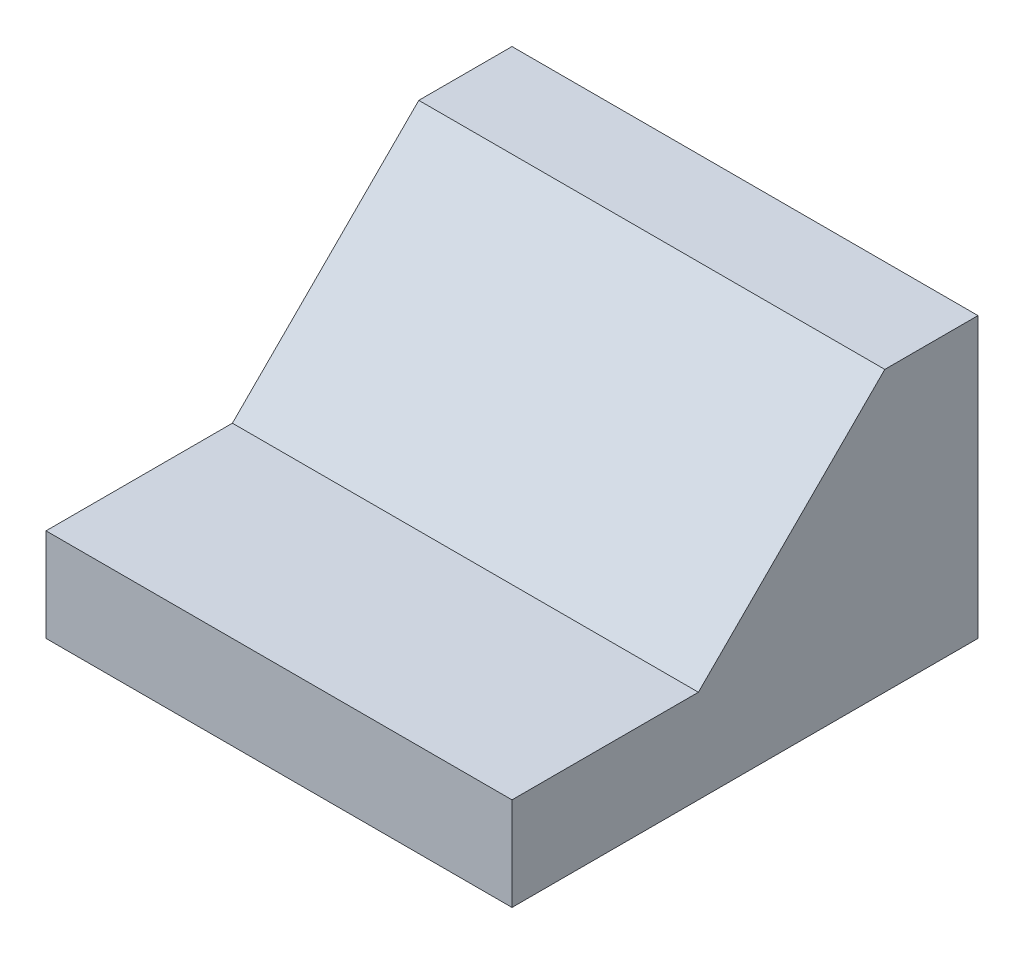
ISO-10303-21;
HEADER;
FILE_DESCRIPTION(('STEP AP214'),'2;1');
FILE_NAME('part.step','',(''),(''),'','','');
FILE_SCHEMA(('AUTOMOTIVE_DESIGN { 1 0 10303 214 1 1 1 1 }'));
ENDSEC;
DATA;
#1=APPLICATION_CONTEXT('core data for automotive mechanical design processes');
#2=APPLICATION_PROTOCOL_DEFINITION('international standard','automotive_design',2000,#1);
#3=PRODUCT_CONTEXT('',#1,'mechanical');
#4=PRODUCT('Part','Part','',(#3));
#5=PRODUCT_RELATED_PRODUCT_CATEGORY('part','',(#4));
#6=PRODUCT_DEFINITION_FORMATION('','',#4);
#7=PRODUCT_DEFINITION_CONTEXT('part definition',#1,'design');
#8=PRODUCT_DEFINITION('design','',#6,#7);
#9=PRODUCT_DEFINITION_SHAPE('','',#8);
#10=(LENGTH_UNIT() NAMED_UNIT(*) SI_UNIT(.MILLI.,.METRE.));
#11=(NAMED_UNIT(*) PLANE_ANGLE_UNIT() SI_UNIT($,.RADIAN.));
#12=(NAMED_UNIT(*) SI_UNIT($,.STERADIAN.) SOLID_ANGLE_UNIT());
#13=UNCERTAINTY_MEASURE_WITH_UNIT(LENGTH_MEASURE(1.E-05),#10,'distance_accuracy_value','');
#14=(GEOMETRIC_REPRESENTATION_CONTEXT(3) GLOBAL_UNCERTAINTY_ASSIGNED_CONTEXT((#13)) GLOBAL_UNIT_ASSIGNED_CONTEXT((#10,
#11,#12)) REPRESENTATION_CONTEXT('',''));
#15=CARTESIAN_POINT('',(0.,0.,0.));
#16=DIRECTION('',(0.,0.,1.));
#17=DIRECTION('',(1.,0.,0.));
#18=AXIS2_PLACEMENT_3D('',#15,#16,#17);
#19=CARTESIAN_POINT('',(10.,0.,9.99999999999999));
#20=DIRECTION('',(0.,1.,0.));
#21=DIRECTION('',(0.,0.,1.));
#22=AXIS2_PLACEMENT_3D('',#19,#20,#21);
#23=PLANE('',#22);
#24=DIRECTION('',(0.,0.,-1.));
#25=VECTOR('',#24,1.);
#26=CARTESIAN_POINT('',(0.,0.,9.99999999999999));
#27=LINE('',#26,#25);
#28=CARTESIAN_POINT('',(0.,0.,9.99999999999999));
#29=VERTEX_POINT('',#28);
#30=CARTESIAN_POINT('',(0.,0.,0.));
#31=VERTEX_POINT('',#30);
#32=EDGE_CURVE('E116',#29,#31,#27,.T.);
#33=ORIENTED_EDGE('',*,*,#32,.T.);
#34=DIRECTION('',(-1.,0.,0.));
#35=VECTOR('',#34,1.);
#36=CARTESIAN_POINT('',(10.,0.,0.));
#37=LINE('',#36,#35);
#38=CARTESIAN_POINT('',(10.,0.,0.));
#39=VERTEX_POINT('',#38);
#40=EDGE_CURVE('E11',#39,#31,#37,.T.);
#41=ORIENTED_EDGE('',*,*,#40,.F.);
#42=DIRECTION('',(0.,0.,-1.));
#43=VECTOR('',#42,1.);
#44=CARTESIAN_POINT('',(10.,0.,9.99999999999999));
#45=LINE('',#44,#43);
#46=CARTESIAN_POINT('',(10.,0.,9.99999999999999));
#47=VERTEX_POINT('',#46);
#48=EDGE_CURVE('E126',#47,#39,#45,.T.);
#49=ORIENTED_EDGE('',*,*,#48,.F.);
#50=DIRECTION('',(-1.,0.,0.));
#51=VECTOR('',#50,1.);
#52=CARTESIAN_POINT('',(10.,0.,9.99999999999999));
#53=LINE('',#52,#51);
#54=EDGE_CURVE('E112',#47,#29,#53,.T.);
#55=ORIENTED_EDGE('',*,*,#54,.T.);
#56=EDGE_LOOP('',(#33,#41,#49,#55));
#57=FACE_BOUND('',#56,.T.);
#58=ADVANCED_FACE('F32',(#57),#23,.F.);
#59=CARTESIAN_POINT('',(10.,0.,0.));
#60=DIRECTION('',(0.,0.,1.));
#61=DIRECTION('',(1.,0.,0.));
#62=AXIS2_PLACEMENT_3D('',#59,#60,#61);
#63=PLANE('',#62);
#64=DIRECTION('',(0.,1.,0.));
#65=VECTOR('',#64,1.);
#66=CARTESIAN_POINT('',(0.,0.,0.));
#67=LINE('',#66,#65);
#68=CARTESIAN_POINT('',(0.,6.,0.));
#69=VERTEX_POINT('',#68);
#70=EDGE_CURVE('E119',#31,#69,#67,.T.);
#71=ORIENTED_EDGE('',*,*,#70,.T.);
#72=DIRECTION('',(-1.,0.,0.));
#73=VECTOR('',#72,1.);
#74=CARTESIAN_POINT('',(10.,6.,0.));
#75=LINE('',#74,#73);
#76=CARTESIAN_POINT('',(10.,6.,0.));
#77=VERTEX_POINT('',#76);
#78=EDGE_CURVE('E40',#77,#69,#75,.T.);
#79=ORIENTED_EDGE('',*,*,#78,.F.);
#80=DIRECTION('',(0.,1.,0.));
#81=VECTOR('',#80,1.);
#82=CARTESIAN_POINT('',(10.,0.,0.));
#83=LINE('',#82,#81);
#84=EDGE_CURVE('E85',#39,#77,#83,.T.);
#85=ORIENTED_EDGE('',*,*,#84,.F.);
#86=ORIENTED_EDGE('',*,*,#40,.T.);
#87=EDGE_LOOP('',(#71,#79,#85,#86));
#88=FACE_BOUND('',#87,.T.);
#89=ADVANCED_FACE('F150',(#88),#63,.F.);
#90=CARTESIAN_POINT('',(10.,6.,0.));
#91=DIRECTION('',(0.,-1.,0.));
#92=DIRECTION('',(0.,0.,-1.));
#93=AXIS2_PLACEMENT_3D('',#90,#91,#92);
#94=PLANE('',#93);
#95=DIRECTION('',(0.,0.,1.));
#96=VECTOR('',#95,1.);
#97=CARTESIAN_POINT('',(0.,6.,0.));
#98=LINE('',#97,#96);
#99=CARTESIAN_POINT('',(0.,6.,2.));
#100=VERTEX_POINT('',#99);
#101=EDGE_CURVE('E121',#69,#100,#98,.T.);
#102=ORIENTED_EDGE('',*,*,#101,.T.);
#103=DIRECTION('',(-1.,0.,0.));
#104=VECTOR('',#103,1.);
#105=CARTESIAN_POINT('',(10.,6.,2.));
#106=LINE('',#105,#104);
#107=CARTESIAN_POINT('',(10.,6.,2.));
#108=VERTEX_POINT('',#107);
#109=EDGE_CURVE('E107',#108,#100,#106,.T.);
#110=ORIENTED_EDGE('',*,*,#109,.F.);
#111=DIRECTION('',(0.,0.,1.));
#112=VECTOR('',#111,1.);
#113=CARTESIAN_POINT('',(10.,6.,0.));
#114=LINE('',#113,#112);
#115=EDGE_CURVE('E98',#77,#108,#114,.T.);
#116=ORIENTED_EDGE('',*,*,#115,.F.);
#117=ORIENTED_EDGE('',*,*,#78,.T.);
#118=EDGE_LOOP('',(#102,#110,#116,#117));
#119=FACE_BOUND('',#118,.T.);
#120=ADVANCED_FACE('F132',(#119),#94,.F.);
#121=CARTESIAN_POINT('',(10.,6.,2.));
#122=DIRECTION('',(0.,-0.707106781186549,-0.707106781186546));
#123=DIRECTION('',(0.,0.707106781186546,-0.707106781186549));
#124=AXIS2_PLACEMENT_3D('',#121,#122,#123);
#125=PLANE('',#124);
#126=DIRECTION('',(0.,-0.707106781186546,0.707106781186549));
#127=VECTOR('',#126,1.);
#128=CARTESIAN_POINT('',(0.,6.,2.));
#129=LINE('',#128,#127);
#130=CARTESIAN_POINT('',(0.,2.,6.00000000000001));
#131=VERTEX_POINT('',#130);
#132=EDGE_CURVE('E106',#100,#131,#129,.T.);
#133=ORIENTED_EDGE('',*,*,#132,.T.);
#134=DIRECTION('',(-1.,0.,0.));
#135=VECTOR('',#134,1.);
#136=CARTESIAN_POINT('',(10.,2.,6.00000000000001));
#137=LINE('',#136,#135);
#138=CARTESIAN_POINT('',(10.,2.,6.00000000000001));
#139=VERTEX_POINT('',#138);
#140=EDGE_CURVE('E103',#139,#131,#137,.T.);
#141=ORIENTED_EDGE('',*,*,#140,.F.);
#142=DIRECTION('',(0.,-0.707106781186546,0.707106781186549));
#143=VECTOR('',#142,1.);
#144=CARTESIAN_POINT('',(10.,6.,2.));
#145=LINE('',#144,#143);
#146=EDGE_CURVE('E92',#108,#139,#145,.T.);
#147=ORIENTED_EDGE('',*,*,#146,.F.);
#148=ORIENTED_EDGE('',*,*,#109,.T.);
#149=EDGE_LOOP('',(#133,#141,#147,#148));
#150=FACE_BOUND('',#149,.T.);
#151=ADVANCED_FACE('F104',(#150),#125,.F.);
#152=CARTESIAN_POINT('',(10.,2.,6.00000000000001));
#153=DIRECTION('',(0.,-1.,0.));
#154=DIRECTION('',(0.,0.,-1.));
#155=AXIS2_PLACEMENT_3D('',#152,#153,#154);
#156=PLANE('',#155);
#157=DIRECTION('',(0.,0.,1.));
#158=VECTOR('',#157,1.);
#159=CARTESIAN_POINT('',(0.,2.,6.00000000000001));
#160=LINE('',#159,#158);
#161=CARTESIAN_POINT('',(0.,2.,9.99999999999999));
#162=VERTEX_POINT('',#161);
#163=EDGE_CURVE('E71',#131,#162,#160,.T.);
#164=ORIENTED_EDGE('',*,*,#163,.T.);
#165=DIRECTION('',(-1.,0.,0.));
#166=VECTOR('',#165,1.);
#167=CARTESIAN_POINT('',(10.,2.,9.99999999999999));
#168=LINE('',#167,#166);
#169=CARTESIAN_POINT('',(10.,2.,9.99999999999999));
#170=VERTEX_POINT('',#169);
#171=EDGE_CURVE('E108',#170,#162,#168,.T.);
#172=ORIENTED_EDGE('',*,*,#171,.F.);
#173=DIRECTION('',(0.,0.,1.));
#174=VECTOR('',#173,1.);
#175=CARTESIAN_POINT('',(10.,2.,6.00000000000001));
#176=LINE('',#175,#174);
#177=EDGE_CURVE('E96',#139,#170,#176,.T.);
#178=ORIENTED_EDGE('',*,*,#177,.F.);
#179=ORIENTED_EDGE('',*,*,#140,.T.);
#180=EDGE_LOOP('',(#164,#172,#178,#179));
#181=FACE_BOUND('',#180,.T.);
#182=ADVANCED_FACE('F110',(#181),#156,.F.);
#183=CARTESIAN_POINT('',(10.,2.,9.99999999999999));
#184=DIRECTION('',(0.,0.,-1.));
#185=DIRECTION('',(-1.,0.,0.));
#186=AXIS2_PLACEMENT_3D('',#183,#184,#185);
#187=PLANE('',#186);
#188=DIRECTION('',(0.,-1.,0.));
#189=VECTOR('',#188,1.);
#190=CARTESIAN_POINT('',(0.,2.,9.99999999999999));
#191=LINE('',#190,#189);
#192=EDGE_CURVE('E77',#162,#29,#191,.T.);
#193=ORIENTED_EDGE('',*,*,#192,.T.);
#194=ORIENTED_EDGE('',*,*,#54,.F.);
#195=DIRECTION('',(0.,-1.,0.));
#196=VECTOR('',#195,1.);
#197=CARTESIAN_POINT('',(10.,2.,9.99999999999999));
#198=LINE('',#197,#196);
#199=EDGE_CURVE('E48',#170,#47,#198,.T.);
#200=ORIENTED_EDGE('',*,*,#199,.F.);
#201=ORIENTED_EDGE('',*,*,#171,.T.);
#202=EDGE_LOOP('',(#193,#194,#200,#201));
#203=FACE_BOUND('',#202,.T.);
#204=ADVANCED_FACE('F139',(#203),#187,.F.);
#205=CARTESIAN_POINT('',(10.,0.,0.));
#206=DIRECTION('',(1.,0.,0.));
#207=DIRECTION('',(0.,0.,-1.));
#208=AXIS2_PLACEMENT_3D('',#205,#206,#207);
#209=PLANE('',#208);
#210=ORIENTED_EDGE('',*,*,#48,.T.);
#211=ORIENTED_EDGE('',*,*,#84,.T.);
#212=ORIENTED_EDGE('',*,*,#115,.T.);
#213=ORIENTED_EDGE('',*,*,#146,.T.);
#214=ORIENTED_EDGE('',*,*,#177,.T.);
#215=ORIENTED_EDGE('',*,*,#199,.T.);
#216=EDGE_LOOP('',(#210,#211,#212,#213,#214,#215));
#217=FACE_BOUND('',#216,.T.);
#218=ADVANCED_FACE('F94',(#217),#209,.T.);
#219=CARTESIAN_POINT('',(0.,0.,0.));
#220=DIRECTION('',(1.,0.,0.));
#221=DIRECTION('',(0.,0.,-1.));
#222=AXIS2_PLACEMENT_3D('',#219,#220,#221);
#223=PLANE('',#222);
#224=ORIENTED_EDGE('',*,*,#32,.F.);
#225=ORIENTED_EDGE('',*,*,#192,.F.);
#226=ORIENTED_EDGE('',*,*,#163,.F.);
#227=ORIENTED_EDGE('',*,*,#132,.F.);
#228=ORIENTED_EDGE('',*,*,#101,.F.);
#229=ORIENTED_EDGE('',*,*,#70,.F.);
#230=EDGE_LOOP('',(#224,#225,#226,#227,#228,#229));
#231=FACE_BOUND('',#230,.T.);
#232=ADVANCED_FACE('F135',(#231),#223,.F.);
#233=CLOSED_SHELL('',(#58,#89,#120,#151,#182,#204,#218,#232));
#234=MANIFOLD_SOLID_BREP('B2',#233);
#235=ADVANCED_BREP_SHAPE_REPRESENTATION('',(#18,#234),#14);
#236=SHAPE_DEFINITION_REPRESENTATION(#9,#235);
ENDSEC;
END-ISO-10303-21;
